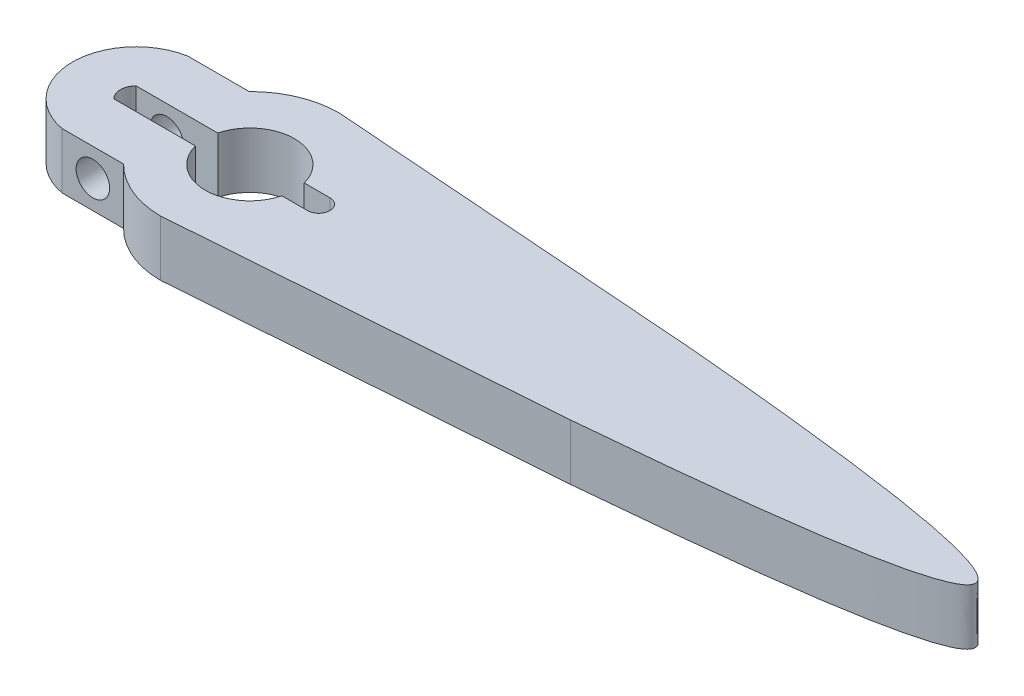
ISO-10303-21;
HEADER;
FILE_DESCRIPTION(('STEP AP214'),'2;1');
FILE_NAME('part.step','',(''),(''),'','','');
FILE_SCHEMA(('AUTOMOTIVE_DESIGN { 1 0 10303 214 1 1 1 1 }'));
ENDSEC;
DATA;
#1=APPLICATION_CONTEXT('core data for automotive mechanical design processes');
#2=APPLICATION_PROTOCOL_DEFINITION('international standard','automotive_design',2000,#1);
#3=PRODUCT_CONTEXT('',#1,'mechanical');
#4=PRODUCT('Part','Part','',(#3));
#5=PRODUCT_RELATED_PRODUCT_CATEGORY('part','',(#4));
#6=PRODUCT_DEFINITION_FORMATION('','',#4);
#7=PRODUCT_DEFINITION_CONTEXT('part definition',#1,'design');
#8=PRODUCT_DEFINITION('design','',#6,#7);
#9=PRODUCT_DEFINITION_SHAPE('','',#8);
#10=(LENGTH_UNIT() NAMED_UNIT(*) SI_UNIT(.MILLI.,.METRE.));
#11=(NAMED_UNIT(*) PLANE_ANGLE_UNIT() SI_UNIT($,.RADIAN.));
#12=(NAMED_UNIT(*) SI_UNIT($,.STERADIAN.) SOLID_ANGLE_UNIT());
#13=UNCERTAINTY_MEASURE_WITH_UNIT(LENGTH_MEASURE(1.E-05),#10,'distance_accuracy_value','');
#14=(GEOMETRIC_REPRESENTATION_CONTEXT(3) GLOBAL_UNCERTAINTY_ASSIGNED_CONTEXT((#13)) GLOBAL_UNIT_ASSIGNED_CONTEXT((#10,
#11,#12)) REPRESENTATION_CONTEXT('',''));
#15=CARTESIAN_POINT('',(0.,0.,0.));
#16=DIRECTION('',(0.,0.,1.));
#17=DIRECTION('',(1.,0.,0.));
#18=AXIS2_PLACEMENT_3D('',#15,#16,#17);
#19=CARTESIAN_POINT('',(-2.5,5.,0.));
#20=DIRECTION('',(0.,-1.,0.));
#21=DIRECTION('',(0.,0.,-1.));
#22=AXIS2_PLACEMENT_3D('',#19,#20,#21);
#23=CYLINDRICAL_SURFACE('',#22,8.);
#24=DIRECTION('',(0.,1.,0.));
#25=VECTOR('',#24,1.);
#26=CARTESIAN_POINT('',(-8.18725393319377,0.,5.62629031417434));
#27=LINE('',#26,#25);
#28=CARTESIAN_POINT('',(-8.18725393319377,0.,5.62629031417434));
#29=VERTEX_POINT('',#28);
#30=CARTESIAN_POINT('',(-8.18725393319377,5.,5.62629031417434));
#31=VERTEX_POINT('',#30);
#32=EDGE_CURVE('E225',#29,#31,#27,.T.);
#33=ORIENTED_EDGE('',*,*,#32,.F.);
#34=CARTESIAN_POINT('',(-2.5,0.,0.));
#35=DIRECTION('',(0.,1.,0.));
#36=DIRECTION('',(0.,0.,1.));
#37=AXIS2_PLACEMENT_3D('',#34,#35,#36);
#38=CIRCLE('',#37,8.);
#39=CARTESIAN_POINT('',(-2.5,0.,8.));
#40=VERTEX_POINT('',#39);
#41=EDGE_CURVE('E336',#29,#40,#38,.T.);
#42=ORIENTED_EDGE('',*,*,#41,.T.);
#43=DIRECTION('',(0.,-1.,0.));
#44=VECTOR('',#43,1.);
#45=CARTESIAN_POINT('',(-2.5,5.,8.));
#46=LINE('',#45,#44);
#47=CARTESIAN_POINT('',(-2.5,5.,8.));
#48=VERTEX_POINT('',#47);
#49=EDGE_CURVE('E11',#48,#40,#46,.T.);
#50=ORIENTED_EDGE('',*,*,#49,.F.);
#51=CARTESIAN_POINT('',(-2.5,5.,0.));
#52=DIRECTION('',(0.,1.,0.));
#53=DIRECTION('',(0.,0.,1.));
#54=AXIS2_PLACEMENT_3D('',#51,#52,#53);
#55=CIRCLE('',#54,8.);
#56=EDGE_CURVE('E295',#31,#48,#55,.T.);
#57=ORIENTED_EDGE('',*,*,#56,.F.);
#58=EDGE_LOOP('',(#33,#42,#50,#57));
#59=FACE_BOUND('',#58,.T.);
#60=ADVANCED_FACE('F45',(#59),#23,.T.);
#61=CARTESIAN_POINT('',(-2.5,5.,0.));
#62=DIRECTION('',(0.,-1.,0.));
#63=DIRECTION('',(0.,0.,-1.));
#64=AXIS2_PLACEMENT_3D('',#61,#62,#63);
#65=CYLINDRICAL_SURFACE('',#64,4.);
#66=DIRECTION('',(0.,1.,0.));
#67=VECTOR('',#66,1.);
#68=CARTESIAN_POINT('',(1.37280536532609,0.,1.00068906374629));
#69=LINE('',#68,#67);
#70=CARTESIAN_POINT('',(1.37280536532609,0.,1.00068906374629));
#71=VERTEX_POINT('',#70);
#72=CARTESIAN_POINT('',(1.37280536532609,5.,1.00068906374629));
#73=VERTEX_POINT('',#72);
#74=EDGE_CURVE('E263',#71,#73,#69,.T.);
#75=ORIENTED_EDGE('',*,*,#74,.F.);
#76=CARTESIAN_POINT('',(-2.5,0.,0.));
#77=DIRECTION('',(0.,1.,0.));
#78=DIRECTION('',(0.,0.,1.));
#79=AXIS2_PLACEMENT_3D('',#76,#77,#78);
#80=CIRCLE('',#79,4.);
#81=CARTESIAN_POINT('',(-6.37298334620742,0.,0.999999999999998));
#82=VERTEX_POINT('',#81);
#83=EDGE_CURVE('E262',#82,#71,#80,.T.);
#84=ORIENTED_EDGE('',*,*,#83,.F.);
#85=DIRECTION('',(0.,1.,0.));
#86=VECTOR('',#85,1.);
#87=CARTESIAN_POINT('',(-6.37298334620742,0.,0.999999999999998));
#88=LINE('',#87,#86);
#89=CARTESIAN_POINT('',(-6.37298334620742,5.,0.999999999999998));
#90=VERTEX_POINT('',#89);
#91=EDGE_CURVE('E224',#82,#90,#88,.T.);
#92=ORIENTED_EDGE('',*,*,#91,.T.);
#93=CARTESIAN_POINT('',(-2.5,5.,0.));
#94=DIRECTION('',(0.,1.,0.));
#95=DIRECTION('',(0.,0.,1.));
#96=AXIS2_PLACEMENT_3D('',#93,#94,#95);
#97=CIRCLE('',#96,4.);
#98=EDGE_CURVE('E284',#90,#73,#97,.T.);
#99=ORIENTED_EDGE('',*,*,#98,.T.);
#100=EDGE_LOOP('',(#75,#84,#92,#99));
#101=FACE_BOUND('',#100,.T.);
#102=ADVANCED_FACE('F323',(#101),#65,.F.);
#103=CARTESIAN_POINT('',(-2.5,5.,0.));
#104=DIRECTION('',(0.,1.,0.));
#105=DIRECTION('',(0.,0.,1.));
#106=AXIS2_PLACEMENT_3D('',#103,#104,#105);
#107=PLANE('',#106);
#108=DIRECTION('',(-1.,0.,0.));
#109=VECTOR('',#108,1.);
#110=CARTESIAN_POINT('',(0.,5.,5.62629031417434));
#111=LINE('',#110,#109);
#112=CARTESIAN_POINT('',(-13.6872539331938,5.,5.62629031417434));
#113=VERTEX_POINT('',#112);
#114=EDGE_CURVE('E193',#31,#113,#111,.T.);
#115=ORIENTED_EDGE('',*,*,#114,.F.);
#116=ORIENTED_EDGE('',*,*,#56,.T.);
#117=DIRECTION('',(0.99725797323496,0.,-0.0740036135556886));
#118=VECTOR('',#117,1.);
#119=CARTESIAN_POINT('',(-2.5,5.,8.));
#120=LINE('',#119,#118);
#121=CARTESIAN_POINT('',(31.6903459605419,5.,5.46283387277255));
#122=VERTEX_POINT('',#121);
#123=EDGE_CURVE('E294',#48,#122,#120,.T.);
#124=ORIENTED_EDGE('',*,*,#123,.T.);
#125=CARTESIAN_POINT('',(31.6903459605419,5.,5.46283387277255));
#126=CARTESIAN_POINT('',(93.3096540394581,5.,0.));
#127=CARTESIAN_POINT('',(31.6903459605419,5.,-5.46283387277255));
#128=B_SPLINE_CURVE_WITH_KNOTS('',2,(#125,#126,#127),.UNSPECIFIED.,.F.,.F.,(3,3),(0.,1.),.UNSPECIFIED.);
#129=CARTESIAN_POINT('',(31.6903459605419,5.,-5.46283387277255));
#130=VERTEX_POINT('',#129);
#131=EDGE_CURVE('E298',#122,#130,#128,.T.);
#132=ORIENTED_EDGE('',*,*,#131,.T.);
#133=DIRECTION('',(-0.99725797323496,0.,-0.0740036135556886));
#134=VECTOR('',#133,1.);
#135=CARTESIAN_POINT('',(-2.5,5.,-8.));
#136=LINE('',#135,#134);
#137=CARTESIAN_POINT('',(-2.5,5.,-8.));
#138=VERTEX_POINT('',#137);
#139=EDGE_CURVE('E304',#130,#138,#136,.T.);
#140=ORIENTED_EDGE('',*,*,#139,.T.);
#141=CARTESIAN_POINT('',(-8.18725393319377,5.,-5.62629031417434));
#142=VERTEX_POINT('',#141);
#143=EDGE_CURVE('E291',#138,#142,#55,.T.);
#144=ORIENTED_EDGE('',*,*,#143,.T.);
#145=DIRECTION('',(-1.,0.,0.));
#146=VECTOR('',#145,1.);
#147=CARTESIAN_POINT('',(0.,5.,-5.62629031417434));
#148=LINE('',#147,#146);
#149=CARTESIAN_POINT('',(-13.6872539331938,5.,-5.62629031417434));
#150=VERTEX_POINT('',#149);
#151=EDGE_CURVE('E215',#142,#150,#148,.T.);
#152=ORIENTED_EDGE('',*,*,#151,.T.);
#153=CARTESIAN_POINT('',(-12.6782032302755,5.,0.));
#154=DIRECTION('',(0.,1.,0.));
#155=DIRECTION('',(0.,0.,1.));
#156=AXIS2_PLACEMENT_3D('',#153,#154,#155);
#157=CIRCLE('',#156,5.71605860890455);
#158=EDGE_CURVE('E201',#150,#113,#157,.T.);
#159=ORIENTED_EDGE('',*,*,#158,.T.);
#160=EDGE_LOOP('',(#115,#116,#124,#132,#140,#144,#152,#159));
#161=FACE_BOUND('',#160,.T.);
#162=DIRECTION('',(1.,0.,0.));
#163=VECTOR('',#162,1.);
#164=CARTESIAN_POINT('',(1.37280536532609,5.,1.00068906374629));
#165=LINE('',#164,#163);
#166=CARTESIAN_POINT('',(3.67232333335017,5.,1.00068906374629));
#167=VERTEX_POINT('',#166);
#168=EDGE_CURVE('E241',#73,#167,#165,.T.);
#169=ORIENTED_EDGE('',*,*,#168,.F.);
#170=ORIENTED_EDGE('',*,*,#98,.F.);
#171=DIRECTION('',(1.,0.,0.));
#172=VECTOR('',#171,1.);
#173=CARTESIAN_POINT('',(-6.37298334620742,5.,0.999999999999998));
#174=LINE('',#173,#172);
#175=CARTESIAN_POINT('',(-13.6872539331938,5.,1.));
#176=VERTEX_POINT('',#175);
#177=EDGE_CURVE('E174',#176,#90,#174,.T.);
#178=ORIENTED_EDGE('',*,*,#177,.F.);
#179=CARTESIAN_POINT('',(-12.6782032302755,5.,0.));
#180=DIRECTION('',(0.,1.,0.));
#181=DIRECTION('',(0.,0.,1.));
#182=AXIS2_PLACEMENT_3D('',#179,#180,#181);
#183=CIRCLE('',#182,1.42062779117538);
#184=CARTESIAN_POINT('',(-13.6872539331938,5.,-0.999999999999999));
#185=VERTEX_POINT('',#184);
#186=EDGE_CURVE('E212',#185,#176,#183,.T.);
#187=ORIENTED_EDGE('',*,*,#186,.F.);
#188=DIRECTION('',(-1.,0.,0.));
#189=VECTOR('',#188,1.);
#190=CARTESIAN_POINT('',(-6.37298334620742,5.,-1.));
#191=LINE('',#190,#189);
#192=CARTESIAN_POINT('',(-6.37298334620742,5.,-1.));
#193=VERTEX_POINT('',#192);
#194=EDGE_CURVE('E181',#193,#185,#191,.T.);
#195=ORIENTED_EDGE('',*,*,#194,.F.);
#196=CARTESIAN_POINT('',(1.37280536532609,5.,-1.00068906374629));
#197=VERTEX_POINT('',#196);
#198=EDGE_CURVE('E288',#197,#193,#97,.T.);
#199=ORIENTED_EDGE('',*,*,#198,.F.);
#200=DIRECTION('',(-1.,0.,0.));
#201=VECTOR('',#200,1.);
#202=CARTESIAN_POINT('',(1.37280536532609,5.,-1.00068906374629));
#203=LINE('',#202,#201);
#204=CARTESIAN_POINT('',(3.67232333335017,5.,-1.00068906374629));
#205=VERTEX_POINT('',#204);
#206=EDGE_CURVE('E253',#205,#197,#203,.T.);
#207=ORIENTED_EDGE('',*,*,#206,.F.);
#208=CARTESIAN_POINT('',(3.67232333335017,5.,0.));
#209=DIRECTION('',(0.,1.,0.));
#210=DIRECTION('',(0.,0.,1.));
#211=AXIS2_PLACEMENT_3D('',#208,#209,#210);
#212=CIRCLE('',#211,1.00068906374629);
#213=EDGE_CURVE('E249',#167,#205,#212,.T.);
#214=ORIENTED_EDGE('',*,*,#213,.F.);
#215=EDGE_LOOP('',(#169,#170,#178,#187,#195,#199,#207,#214));
#216=FACE_BOUND('',#215,.T.);
#217=ADVANCED_FACE('F328',(#161,#216),#107,.T.);
#218=CARTESIAN_POINT('',(-2.5,0.,0.));
#219=DIRECTION('',(0.,1.,0.));
#220=DIRECTION('',(0.,0.,1.));
#221=AXIS2_PLACEMENT_3D('',#218,#219,#220);
#222=PLANE('',#221);
#223=ORIENTED_EDGE('',*,*,#41,.F.);
#224=DIRECTION('',(-1.,0.,0.));
#225=VECTOR('',#224,1.);
#226=CARTESIAN_POINT('',(0.,0.,5.62629031417434));
#227=LINE('',#226,#225);
#228=CARTESIAN_POINT('',(-13.6872539331938,0.,5.62629031417434));
#229=VERTEX_POINT('',#228);
#230=EDGE_CURVE('E186',#29,#229,#227,.T.);
#231=ORIENTED_EDGE('',*,*,#230,.T.);
#232=CARTESIAN_POINT('',(-12.6782032302755,0.,0.));
#233=DIRECTION('',(0.,1.,0.));
#234=DIRECTION('',(0.,0.,1.));
#235=AXIS2_PLACEMENT_3D('',#232,#233,#234);
#236=CIRCLE('',#235,5.71605860890455);
#237=CARTESIAN_POINT('',(-13.6872539331938,0.,-5.62629031417434));
#238=VERTEX_POINT('',#237);
#239=EDGE_CURVE('E198',#238,#229,#236,.T.);
#240=ORIENTED_EDGE('',*,*,#239,.F.);
#241=DIRECTION('',(-1.,0.,0.));
#242=VECTOR('',#241,1.);
#243=CARTESIAN_POINT('',(0.,0.,-5.62629031417434));
#244=LINE('',#243,#242);
#245=CARTESIAN_POINT('',(-8.18725393319377,0.,-5.62629031417434));
#246=VERTEX_POINT('',#245);
#247=EDGE_CURVE('E192',#246,#238,#244,.T.);
#248=ORIENTED_EDGE('',*,*,#247,.F.);
#249=CARTESIAN_POINT('',(-2.5,0.,-8.));
#250=VERTEX_POINT('',#249);
#251=EDGE_CURVE('E67',#250,#246,#38,.T.);
#252=ORIENTED_EDGE('',*,*,#251,.F.);
#253=DIRECTION('',(-0.99725797323496,0.,-0.0740036135556886));
#254=VECTOR('',#253,1.);
#255=CARTESIAN_POINT('',(-2.5,0.,-8.));
#256=LINE('',#255,#254);
#257=CARTESIAN_POINT('',(31.6903459605419,0.,-5.46283387277255));
#258=VERTEX_POINT('',#257);
#259=EDGE_CURVE('E357',#258,#250,#256,.T.);
#260=ORIENTED_EDGE('',*,*,#259,.F.);
#261=CARTESIAN_POINT('',(31.6903459605419,0.,5.46283387277255));
#262=CARTESIAN_POINT('',(93.3096540394581,0.,0.));
#263=CARTESIAN_POINT('',(31.6903459605419,0.,-5.46283387277255));
#264=B_SPLINE_CURVE_WITH_KNOTS('',2,(#261,#262,#263),.UNSPECIFIED.,.F.,.F.,(3,3),(0.,1.),.UNSPECIFIED.);
#265=CARTESIAN_POINT('',(31.6903459605419,0.,5.46283387277255));
#266=VERTEX_POINT('',#265);
#267=EDGE_CURVE('E352',#266,#258,#264,.T.);
#268=ORIENTED_EDGE('',*,*,#267,.F.);
#269=DIRECTION('',(0.99725797323496,0.,-0.0740036135556886));
#270=VECTOR('',#269,1.);
#271=CARTESIAN_POINT('',(-2.5,0.,8.));
#272=LINE('',#271,#270);
#273=EDGE_CURVE('E344',#40,#266,#272,.T.);
#274=ORIENTED_EDGE('',*,*,#273,.F.);
#275=EDGE_LOOP('',(#223,#231,#240,#248,#252,#260,#268,#274));
#276=FACE_BOUND('',#275,.T.);
#277=ORIENTED_EDGE('',*,*,#83,.T.);
#278=DIRECTION('',(1.,0.,0.));
#279=VECTOR('',#278,1.);
#280=CARTESIAN_POINT('',(1.37280536532609,0.,1.00068906374629));
#281=LINE('',#280,#279);
#282=CARTESIAN_POINT('',(3.67232333335017,0.,1.00068906374629));
#283=VERTEX_POINT('',#282);
#284=EDGE_CURVE('E244',#71,#283,#281,.T.);
#285=ORIENTED_EDGE('',*,*,#284,.T.);
#286=CARTESIAN_POINT('',(3.67232333335017,0.,0.));
#287=DIRECTION('',(0.,1.,0.));
#288=DIRECTION('',(0.,0.,1.));
#289=AXIS2_PLACEMENT_3D('',#286,#287,#288);
#290=CIRCLE('',#289,1.00068906374629);
#291=CARTESIAN_POINT('',(3.67232333335017,0.,-1.00068906374629));
#292=VERTEX_POINT('',#291);
#293=EDGE_CURVE('E236',#283,#292,#290,.T.);
#294=ORIENTED_EDGE('',*,*,#293,.T.);
#295=DIRECTION('',(-1.,0.,0.));
#296=VECTOR('',#295,1.);
#297=CARTESIAN_POINT('',(1.37280536532609,0.,-1.00068906374629));
#298=LINE('',#297,#296);
#299=CARTESIAN_POINT('',(1.37280536532609,0.,-1.00068906374629));
#300=VERTEX_POINT('',#299);
#301=EDGE_CURVE('E240',#292,#300,#298,.T.);
#302=ORIENTED_EDGE('',*,*,#301,.T.);
#303=CARTESIAN_POINT('',(-6.37298334620742,0.,-1.));
#304=VERTEX_POINT('',#303);
#305=EDGE_CURVE('E170',#300,#304,#80,.T.);
#306=ORIENTED_EDGE('',*,*,#305,.T.);
#307=DIRECTION('',(-1.,0.,0.));
#308=VECTOR('',#307,1.);
#309=CARTESIAN_POINT('',(-6.37298334620742,0.,-1.));
#310=LINE('',#309,#308);
#311=CARTESIAN_POINT('',(-13.6872539331938,0.,-0.999999999999999));
#312=VERTEX_POINT('',#311);
#313=EDGE_CURVE('E160',#304,#312,#310,.T.);
#314=ORIENTED_EDGE('',*,*,#313,.T.);
#315=CARTESIAN_POINT('',(-12.6782032302755,0.,0.));
#316=DIRECTION('',(0.,1.,0.));
#317=DIRECTION('',(0.,0.,1.));
#318=AXIS2_PLACEMENT_3D('',#315,#316,#317);
#319=CIRCLE('',#318,1.42062779117538);
#320=CARTESIAN_POINT('',(-13.6872539331938,0.,1.));
#321=VERTEX_POINT('',#320);
#322=EDGE_CURVE('E166',#312,#321,#319,.T.);
#323=ORIENTED_EDGE('',*,*,#322,.T.);
#324=DIRECTION('',(1.,0.,0.));
#325=VECTOR('',#324,1.);
#326=CARTESIAN_POINT('',(-6.37298334620742,0.,0.999999999999998));
#327=LINE('',#326,#325);
#328=EDGE_CURVE('E175',#321,#82,#327,.T.);
#329=ORIENTED_EDGE('',*,*,#328,.T.);
#330=EDGE_LOOP('',(#277,#285,#294,#302,#306,#314,#323,#329));
#331=FACE_BOUND('',#330,.T.);
#332=ADVANCED_FACE('F163',(#276,#331),#222,.F.);
#333=ORIENTED_EDGE('',*,*,#251,.T.);
#334=DIRECTION('',(0.,1.,0.));
#335=VECTOR('',#334,1.);
#336=CARTESIAN_POINT('',(-8.18725393319377,0.,-5.62629031417434));
#337=LINE('',#336,#335);
#338=EDGE_CURVE('E62',#246,#142,#337,.T.);
#339=ORIENTED_EDGE('',*,*,#338,.T.);
#340=ORIENTED_EDGE('',*,*,#143,.F.);
#341=DIRECTION('',(0.,-1.,0.));
#342=VECTOR('',#341,1.);
#343=CARTESIAN_POINT('',(-2.5,5.,-8.));
#344=LINE('',#343,#342);
#345=EDGE_CURVE('E363',#138,#250,#344,.T.);
#346=ORIENTED_EDGE('',*,*,#345,.T.);
#347=EDGE_LOOP('',(#333,#339,#340,#346));
#348=FACE_BOUND('',#347,.T.);
#349=ADVANCED_FACE('F47',(#348),#23,.T.);
#350=CARTESIAN_POINT('',(-2.5,5.,8.));
#351=DIRECTION('',(-0.0740036135556886,0.,-0.99725797323496));
#352=DIRECTION('',(-0.99725797323496,0.,0.0740036135556886));
#353=AXIS2_PLACEMENT_3D('',#350,#351,#352);
#354=PLANE('',#353);
#355=ORIENTED_EDGE('',*,*,#273,.T.);
#356=DIRECTION('',(0.,-1.,0.));
#357=VECTOR('',#356,1.);
#358=CARTESIAN_POINT('',(31.6903459605419,5.,5.46283387277255));
#359=LINE('',#358,#357);
#360=EDGE_CURVE('E55',#122,#266,#359,.T.);
#361=ORIENTED_EDGE('',*,*,#360,.F.);
#362=ORIENTED_EDGE('',*,*,#123,.F.);
#363=ORIENTED_EDGE('',*,*,#49,.T.);
#364=EDGE_LOOP('',(#355,#361,#362,#363));
#365=FACE_BOUND('',#364,.T.);
#366=ADVANCED_FACE('F314',(#365),#354,.F.);
#367=DIRECTION('',(0.,-1.,0.));
#368=VECTOR('',#367,1.);
#369=SURFACE_OF_LINEAR_EXTRUSION('',#128,#368);
#370=ORIENTED_EDGE('',*,*,#267,.T.);
#371=DIRECTION('',(0.,-1.,0.));
#372=VECTOR('',#371,1.);
#373=CARTESIAN_POINT('',(31.6903459605419,5.,-5.46283387277255));
#374=LINE('',#373,#372);
#375=EDGE_CURVE('E366',#130,#258,#374,.T.);
#376=ORIENTED_EDGE('',*,*,#375,.F.);
#377=ORIENTED_EDGE('',*,*,#131,.F.);
#378=ORIENTED_EDGE('',*,*,#360,.T.);
#379=EDGE_LOOP('',(#370,#376,#377,#378));
#380=FACE_BOUND('',#379,.T.);
#381=ADVANCED_FACE('F310',(#380),#369,.F.);
#382=CARTESIAN_POINT('',(-2.5,5.,-8.));
#383=DIRECTION('',(-0.0740036135556886,0.,0.99725797323496));
#384=DIRECTION('',(0.99725797323496,0.,0.0740036135556886));
#385=AXIS2_PLACEMENT_3D('',#382,#383,#384);
#386=PLANE('',#385);
#387=ORIENTED_EDGE('',*,*,#259,.T.);
#388=ORIENTED_EDGE('',*,*,#345,.F.);
#389=ORIENTED_EDGE('',*,*,#139,.F.);
#390=ORIENTED_EDGE('',*,*,#375,.T.);
#391=EDGE_LOOP('',(#387,#388,#389,#390));
#392=FACE_BOUND('',#391,.T.);
#393=ADVANCED_FACE('F313',(#392),#386,.F.);
#394=DIRECTION('',(0.,1.,0.));
#395=VECTOR('',#394,1.);
#396=CARTESIAN_POINT('',(1.37280536532609,0.,-1.00068906374629));
#397=LINE('',#396,#395);
#398=EDGE_CURVE('E266',#300,#197,#397,.T.);
#399=ORIENTED_EDGE('',*,*,#398,.T.);
#400=ORIENTED_EDGE('',*,*,#198,.T.);
#401=DIRECTION('',(0.,1.,0.));
#402=VECTOR('',#401,1.);
#403=CARTESIAN_POINT('',(-6.37298334620742,0.,-1.));
#404=LINE('',#403,#402);
#405=EDGE_CURVE('E272',#304,#193,#404,.T.);
#406=ORIENTED_EDGE('',*,*,#405,.F.);
#407=ORIENTED_EDGE('',*,*,#305,.F.);
#408=EDGE_LOOP('',(#399,#400,#406,#407));
#409=FACE_BOUND('',#408,.T.);
#410=ADVANCED_FACE('F331',(#409),#65,.F.);
#411=CARTESIAN_POINT('',(-6.37298334620742,0.,-1.));
#412=DIRECTION('',(0.,0.,-1.));
#413=DIRECTION('',(-1.,0.,0.));
#414=AXIS2_PLACEMENT_3D('',#411,#412,#413);
#415=PLANE('',#414);
#416=CARTESIAN_POINT('',(-10.9372539331938,2.5,-1.));
#417=DIRECTION('',(0.,0.,-1.));
#418=DIRECTION('',(-1.,0.,0.));
#419=AXIS2_PLACEMENT_3D('',#416,#417,#418);
#420=CIRCLE('',#419,1.5);
#421=CARTESIAN_POINT('',(-12.4372539331938,2.5,-1.));
#422=VERTEX_POINT('',#421);
#423=EDGE_CURVE('E204',#422,#422,#420,.T.);
#424=ORIENTED_EDGE('',*,*,#423,.T.);
#425=EDGE_LOOP('',(#424));
#426=FACE_BOUND('',#425,.T.);
#427=ORIENTED_EDGE('',*,*,#194,.T.);
#428=DIRECTION('',(0.,1.,0.));
#429=VECTOR('',#428,1.);
#430=CARTESIAN_POINT('',(-13.6872539331938,0.,-0.999999999999999));
#431=LINE('',#430,#429);
#432=EDGE_CURVE('E178',#312,#185,#431,.T.);
#433=ORIENTED_EDGE('',*,*,#432,.F.);
#434=ORIENTED_EDGE('',*,*,#313,.F.);
#435=ORIENTED_EDGE('',*,*,#405,.T.);
#436=EDGE_LOOP('',(#427,#433,#434,#435));
#437=FACE_BOUND('',#436,.T.);
#438=ADVANCED_FACE('F179',(#426,#437),#415,.F.);
#439=CARTESIAN_POINT('',(-6.37298334620742,0.,0.999999999999998));
#440=DIRECTION('',(0.,0.,1.));
#441=DIRECTION('',(1.,0.,0.));
#442=AXIS2_PLACEMENT_3D('',#439,#440,#441);
#443=PLANE('',#442);
#444=CARTESIAN_POINT('',(-10.9372539331938,2.5,1.));
#445=DIRECTION('',(0.,0.,1.));
#446=DIRECTION('',(1.,0.,0.));
#447=AXIS2_PLACEMENT_3D('',#444,#445,#446);
#448=CIRCLE('',#447,1.5);
#449=CARTESIAN_POINT('',(-9.43725393319377,2.5,1.));
#450=VERTEX_POINT('',#449);
#451=EDGE_CURVE('E606',#450,#450,#448,.T.);
#452=ORIENTED_EDGE('',*,*,#451,.T.);
#453=EDGE_LOOP('',(#452));
#454=FACE_BOUND('',#453,.T.);
#455=ORIENTED_EDGE('',*,*,#177,.T.);
#456=ORIENTED_EDGE('',*,*,#91,.F.);
#457=ORIENTED_EDGE('',*,*,#328,.F.);
#458=DIRECTION('',(0.,1.,0.));
#459=VECTOR('',#458,1.);
#460=CARTESIAN_POINT('',(-13.6872539331938,0.,1.));
#461=LINE('',#460,#459);
#462=EDGE_CURVE('E190',#321,#176,#461,.T.);
#463=ORIENTED_EDGE('',*,*,#462,.T.);
#464=EDGE_LOOP('',(#455,#456,#457,#463));
#465=FACE_BOUND('',#464,.T.);
#466=ADVANCED_FACE('F417',(#454,#465),#443,.F.);
#467=CARTESIAN_POINT('',(3.67232333335017,0.,0.));
#468=DIRECTION('',(0.,1.,0.));
#469=DIRECTION('',(0.,0.,1.));
#470=AXIS2_PLACEMENT_3D('',#467,#468,#469);
#471=CYLINDRICAL_SURFACE('',#470,1.00068906374629);
#472=ORIENTED_EDGE('',*,*,#213,.T.);
#473=DIRECTION('',(0.,1.,0.));
#474=VECTOR('',#473,1.);
#475=CARTESIAN_POINT('',(3.67232333335017,0.,-1.00068906374629));
#476=LINE('',#475,#474);
#477=EDGE_CURVE('E248',#292,#205,#476,.T.);
#478=ORIENTED_EDGE('',*,*,#477,.F.);
#479=ORIENTED_EDGE('',*,*,#293,.F.);
#480=DIRECTION('',(0.,1.,0.));
#481=VECTOR('',#480,1.);
#482=CARTESIAN_POINT('',(3.67232333335017,0.,1.00068906374629));
#483=LINE('',#482,#481);
#484=EDGE_CURVE('E259',#283,#167,#483,.T.);
#485=ORIENTED_EDGE('',*,*,#484,.T.);
#486=EDGE_LOOP('',(#472,#478,#479,#485));
#487=FACE_BOUND('',#486,.T.);
#488=ADVANCED_FACE('F410',(#487),#471,.F.);
#489=CARTESIAN_POINT('',(1.37280536532609,0.,1.00068906374629));
#490=DIRECTION('',(0.,0.,1.));
#491=DIRECTION('',(1.,0.,0.));
#492=AXIS2_PLACEMENT_3D('',#489,#490,#491);
#493=PLANE('',#492);
#494=ORIENTED_EDGE('',*,*,#168,.T.);
#495=ORIENTED_EDGE('',*,*,#484,.F.);
#496=ORIENTED_EDGE('',*,*,#284,.F.);
#497=ORIENTED_EDGE('',*,*,#74,.T.);
#498=EDGE_LOOP('',(#494,#495,#496,#497));
#499=FACE_BOUND('',#498,.T.);
#500=ADVANCED_FACE('F407',(#499),#493,.F.);
#501=CARTESIAN_POINT('',(1.37280536532609,0.,-1.00068906374629));
#502=DIRECTION('',(0.,0.,-1.));
#503=DIRECTION('',(-1.,0.,0.));
#504=AXIS2_PLACEMENT_3D('',#501,#502,#503);
#505=PLANE('',#504);
#506=ORIENTED_EDGE('',*,*,#206,.T.);
#507=ORIENTED_EDGE('',*,*,#398,.F.);
#508=ORIENTED_EDGE('',*,*,#301,.F.);
#509=ORIENTED_EDGE('',*,*,#477,.T.);
#510=EDGE_LOOP('',(#506,#507,#508,#509));
#511=FACE_BOUND('',#510,.T.);
#512=ADVANCED_FACE('F398',(#511),#505,.F.);
#513=CARTESIAN_POINT('',(-12.6782032302755,0.,0.));
#514=DIRECTION('',(0.,1.,0.));
#515=DIRECTION('',(0.,0.,1.));
#516=AXIS2_PLACEMENT_3D('',#513,#514,#515);
#517=CYLINDRICAL_SURFACE('',#516,1.42062779117538);
#518=ORIENTED_EDGE('',*,*,#186,.T.);
#519=ORIENTED_EDGE('',*,*,#462,.F.);
#520=ORIENTED_EDGE('',*,*,#322,.F.);
#521=ORIENTED_EDGE('',*,*,#432,.T.);
#522=EDGE_LOOP('',(#518,#519,#520,#521));
#523=FACE_BOUND('',#522,.T.);
#524=ADVANCED_FACE('F188',(#523),#517,.F.);
#525=CARTESIAN_POINT('',(0.,0.,5.62629031417434));
#526=DIRECTION('',(0.,0.,-1.));
#527=DIRECTION('',(-1.,0.,0.));
#528=AXIS2_PLACEMENT_3D('',#525,#526,#527);
#529=PLANE('',#528);
#530=CARTESIAN_POINT('',(-10.9372539331938,2.5,5.62629031417434));
#531=DIRECTION('',(0.,0.,-1.));
#532=DIRECTION('',(-1.,0.,0.));
#533=AXIS2_PLACEMENT_3D('',#530,#531,#532);
#534=CIRCLE('',#533,1.5);
#535=CARTESIAN_POINT('',(-12.4372539331938,2.5,5.62629031417434));
#536=VERTEX_POINT('',#535);
#537=EDGE_CURVE('E603',#536,#536,#534,.T.);
#538=ORIENTED_EDGE('',*,*,#537,.T.);
#539=EDGE_LOOP('',(#538));
#540=FACE_BOUND('',#539,.T.);
#541=ORIENTED_EDGE('',*,*,#114,.T.);
#542=DIRECTION('',(0.,1.,0.));
#543=VECTOR('',#542,1.);
#544=CARTESIAN_POINT('',(-13.6872539331938,0.,5.62629031417434));
#545=LINE('',#544,#543);
#546=EDGE_CURVE('E228',#229,#113,#545,.T.);
#547=ORIENTED_EDGE('',*,*,#546,.F.);
#548=ORIENTED_EDGE('',*,*,#230,.F.);
#549=ORIENTED_EDGE('',*,*,#32,.T.);
#550=EDGE_LOOP('',(#541,#547,#548,#549));
#551=FACE_BOUND('',#550,.T.);
#552=ADVANCED_FACE('F389',(#540,#551),#529,.F.);
#553=CARTESIAN_POINT('',(-12.6782032302755,0.,0.));
#554=DIRECTION('',(0.,1.,0.));
#555=DIRECTION('',(0.,0.,1.));
#556=AXIS2_PLACEMENT_3D('',#553,#554,#555);
#557=CYLINDRICAL_SURFACE('',#556,5.71605860890455);
#558=ORIENTED_EDGE('',*,*,#158,.F.);
#559=DIRECTION('',(0.,1.,0.));
#560=VECTOR('',#559,1.);
#561=CARTESIAN_POINT('',(-13.6872539331938,0.,-5.62629031417434));
#562=LINE('',#561,#560);
#563=EDGE_CURVE('E231',#238,#150,#562,.T.);
#564=ORIENTED_EDGE('',*,*,#563,.F.);
#565=ORIENTED_EDGE('',*,*,#239,.T.);
#566=ORIENTED_EDGE('',*,*,#546,.T.);
#567=EDGE_LOOP('',(#558,#564,#565,#566));
#568=FACE_BOUND('',#567,.T.);
#569=ADVANCED_FACE('F388',(#568),#557,.T.);
#570=CARTESIAN_POINT('',(0.,0.,-5.62629031417434));
#571=DIRECTION('',(0.,0.,-1.));
#572=DIRECTION('',(-1.,0.,0.));
#573=AXIS2_PLACEMENT_3D('',#570,#571,#572);
#574=PLANE('',#573);
#575=CARTESIAN_POINT('',(-10.9372539331938,2.5,-5.62629031417434));
#576=DIRECTION('',(0.,0.,-1.));
#577=DIRECTION('',(-1.,0.,0.));
#578=AXIS2_PLACEMENT_3D('',#575,#576,#577);
#579=CIRCLE('',#578,1.5);
#580=CARTESIAN_POINT('',(-12.4372539331938,2.5,-5.62629031417434));
#581=VERTEX_POINT('',#580);
#582=EDGE_CURVE('E49',#581,#581,#579,.T.);
#583=ORIENTED_EDGE('',*,*,#582,.F.);
#584=EDGE_LOOP('',(#583));
#585=FACE_BOUND('',#584,.T.);
#586=ORIENTED_EDGE('',*,*,#151,.F.);
#587=ORIENTED_EDGE('',*,*,#338,.F.);
#588=ORIENTED_EDGE('',*,*,#247,.T.);
#589=ORIENTED_EDGE('',*,*,#563,.T.);
#590=EDGE_LOOP('',(#586,#587,#588,#589));
#591=FACE_BOUND('',#590,.T.);
#592=ADVANCED_FACE('F385',(#585,#591),#574,.T.);
#593=CARTESIAN_POINT('',(-10.9372539331938,2.5,8.));
#594=DIRECTION('',(0.,0.,-1.));
#595=DIRECTION('',(-1.,0.,0.));
#596=AXIS2_PLACEMENT_3D('',#593,#594,#595);
#597=CYLINDRICAL_SURFACE('',#596,1.5);
#598=ORIENTED_EDGE('',*,*,#582,.T.);
#599=EDGE_LOOP('',(#598));
#600=FACE_BOUND('',#599,.T.);
#601=ORIENTED_EDGE('',*,*,#423,.F.);
#602=EDGE_LOOP('',(#601));
#603=FACE_BOUND('',#602,.T.);
#604=ADVANCED_FACE('F402',(#600,#603),#597,.F.);
#605=ORIENTED_EDGE('',*,*,#537,.F.);
#606=EDGE_LOOP('',(#605));
#607=FACE_BOUND('',#606,.T.);
#608=ORIENTED_EDGE('',*,*,#451,.F.);
#609=EDGE_LOOP('',(#608));
#610=FACE_BOUND('',#609,.T.);
#611=ADVANCED_FACE('F489',(#607,#610),#597,.F.);
#612=CLOSED_SHELL('',(#60,#102,#217,#332,#349,#366,#381,#393,#410,#438,#466,#488,#500,#512,#524,
#552,#569,#592,#604,#611));
#613=MANIFOLD_SOLID_BREP('B2',#612);
#614=ADVANCED_BREP_SHAPE_REPRESENTATION('',(#18,#613),#14);
#615=SHAPE_DEFINITION_REPRESENTATION(#9,#614);
ENDSEC;
END-ISO-10303-21;
